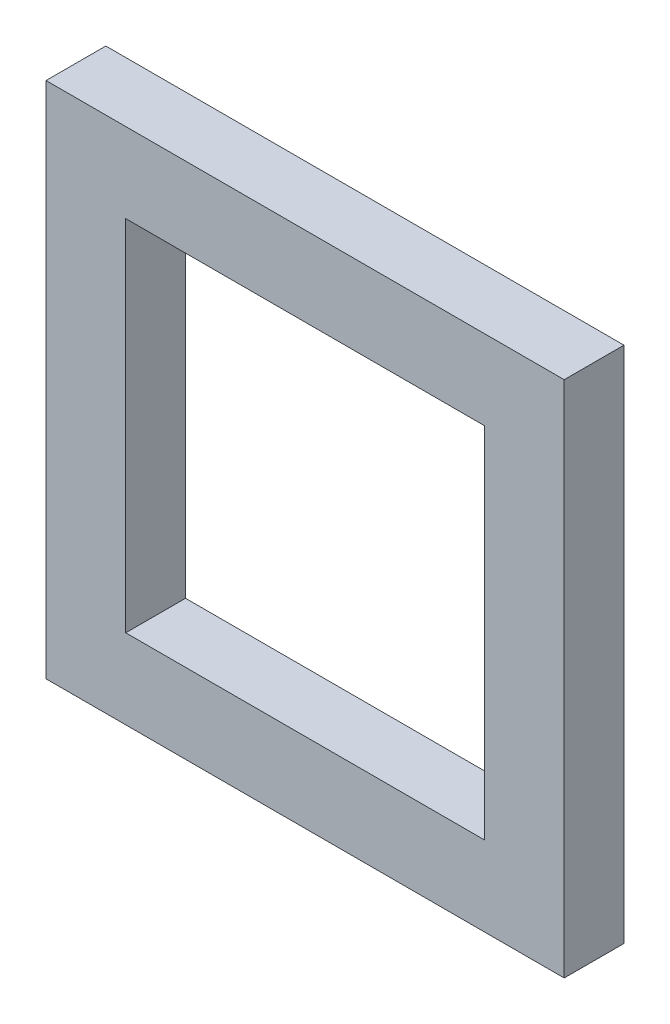
ISO-10303-21;
HEADER;
FILE_DESCRIPTION(('STEP AP214'),'2;1');
FILE_NAME('part.step','',(''),(''),'','','');
FILE_SCHEMA(('AUTOMOTIVE_DESIGN { 1 0 10303 214 1 1 1 1 }'));
ENDSEC;
DATA;
#1=APPLICATION_CONTEXT('core data for automotive mechanical design processes');
#2=APPLICATION_PROTOCOL_DEFINITION('international standard','automotive_design',2000,#1);
#3=PRODUCT_CONTEXT('',#1,'mechanical');
#4=PRODUCT('Part','Part','',(#3));
#5=PRODUCT_RELATED_PRODUCT_CATEGORY('part','',(#4));
#6=PRODUCT_DEFINITION_FORMATION('','',#4);
#7=PRODUCT_DEFINITION_CONTEXT('part definition',#1,'design');
#8=PRODUCT_DEFINITION('design','',#6,#7);
#9=PRODUCT_DEFINITION_SHAPE('','',#8);
#10=(LENGTH_UNIT() NAMED_UNIT(*) SI_UNIT(.MILLI.,.METRE.));
#11=(NAMED_UNIT(*) PLANE_ANGLE_UNIT() SI_UNIT($,.RADIAN.));
#12=(NAMED_UNIT(*) SI_UNIT($,.STERADIAN.) SOLID_ANGLE_UNIT());
#13=UNCERTAINTY_MEASURE_WITH_UNIT(LENGTH_MEASURE(1.E-05),#10,'distance_accuracy_value','');
#14=(GEOMETRIC_REPRESENTATION_CONTEXT(3) GLOBAL_UNCERTAINTY_ASSIGNED_CONTEXT((#13)) GLOBAL_UNIT_ASSIGNED_CONTEXT((#10,
#11,#12)) REPRESENTATION_CONTEXT('',''));
#15=CARTESIAN_POINT('',(0.,0.,0.));
#16=DIRECTION('',(0.,0.,1.));
#17=DIRECTION('',(1.,0.,0.));
#18=AXIS2_PLACEMENT_3D('',#15,#16,#17);
#19=CARTESIAN_POINT('',(0.,0.,1.5));
#20=DIRECTION('',(0.,0.,1.));
#21=DIRECTION('',(1.,0.,0.));
#22=AXIS2_PLACEMENT_3D('',#19,#20,#21);
#23=PLANE('',#22);
#24=DIRECTION('',(0.,-1.,0.));
#25=VECTOR('',#24,1.);
#26=CARTESIAN_POINT('',(-6.5,-6.5,1.5));
#27=LINE('',#26,#25);
#28=CARTESIAN_POINT('',(-6.5,6.5,1.5));
#29=VERTEX_POINT('',#28);
#30=CARTESIAN_POINT('',(-6.5,-6.5,1.5));
#31=VERTEX_POINT('',#30);
#32=EDGE_CURVE('E134',#29,#31,#27,.T.);
#33=ORIENTED_EDGE('',*,*,#32,.T.);
#34=DIRECTION('',(1.,0.,0.));
#35=VECTOR('',#34,1.);
#36=CARTESIAN_POINT('',(6.5,-6.5,1.5));
#37=LINE('',#36,#35);
#38=CARTESIAN_POINT('',(6.5,-6.5,1.5));
#39=VERTEX_POINT('',#38);
#40=EDGE_CURVE('E137',#31,#39,#37,.T.);
#41=ORIENTED_EDGE('',*,*,#40,.T.);
#42=DIRECTION('',(0.,1.,0.));
#43=VECTOR('',#42,1.);
#44=CARTESIAN_POINT('',(6.5,-6.5,1.5));
#45=LINE('',#44,#43);
#46=CARTESIAN_POINT('',(6.5,6.5,1.5));
#47=VERTEX_POINT('',#46);
#48=EDGE_CURVE('E140',#39,#47,#45,.T.);
#49=ORIENTED_EDGE('',*,*,#48,.T.);
#50=DIRECTION('',(-1.,0.,0.));
#51=VECTOR('',#50,1.);
#52=CARTESIAN_POINT('',(6.5,6.5,1.5));
#53=LINE('',#52,#51);
#54=EDGE_CURVE('E142',#47,#29,#53,.T.);
#55=ORIENTED_EDGE('',*,*,#54,.T.);
#56=EDGE_LOOP('',(#33,#41,#49,#55));
#57=FACE_BOUND('',#56,.T.);
#58=DIRECTION('',(1.,0.,0.));
#59=VECTOR('',#58,1.);
#60=CARTESIAN_POINT('',(4.5,-4.5,1.5));
#61=LINE('',#60,#59);
#62=CARTESIAN_POINT('',(-4.5,-4.5,1.5));
#63=VERTEX_POINT('',#62);
#64=CARTESIAN_POINT('',(4.5,-4.5,1.5));
#65=VERTEX_POINT('',#64);
#66=EDGE_CURVE('E106',#63,#65,#61,.T.);
#67=ORIENTED_EDGE('',*,*,#66,.F.);
#68=DIRECTION('',(0.,-1.,0.));
#69=VECTOR('',#68,1.);
#70=CARTESIAN_POINT('',(-4.5,-4.5,1.5));
#71=LINE('',#70,#69);
#72=CARTESIAN_POINT('',(-4.5,4.5,1.5));
#73=VERTEX_POINT('',#72);
#74=EDGE_CURVE('E98',#73,#63,#71,.T.);
#75=ORIENTED_EDGE('',*,*,#74,.F.);
#76=DIRECTION('',(-1.,0.,0.));
#77=VECTOR('',#76,1.);
#78=CARTESIAN_POINT('',(4.5,4.5,1.5));
#79=LINE('',#78,#77);
#80=CARTESIAN_POINT('',(4.5,4.5,1.5));
#81=VERTEX_POINT('',#80);
#82=EDGE_CURVE('E120',#81,#73,#79,.T.);
#83=ORIENTED_EDGE('',*,*,#82,.F.);
#84=DIRECTION('',(0.,1.,0.));
#85=VECTOR('',#84,1.);
#86=CARTESIAN_POINT('',(4.5,-4.5,1.5));
#87=LINE('',#86,#85);
#88=EDGE_CURVE('E118',#65,#81,#87,.T.);
#89=ORIENTED_EDGE('',*,*,#88,.F.);
#90=EDGE_LOOP('',(#67,#75,#83,#89));
#91=FACE_BOUND('',#90,.T.);
#92=ADVANCED_FACE('F33',(#57,#91),#23,.T.);
#93=CARTESIAN_POINT('',(0.,0.,0.));
#94=DIRECTION('',(0.,0.,1.));
#95=DIRECTION('',(1.,0.,0.));
#96=AXIS2_PLACEMENT_3D('',#93,#94,#95);
#97=PLANE('',#96);
#98=DIRECTION('',(0.,-1.,0.));
#99=VECTOR('',#98,1.);
#100=CARTESIAN_POINT('',(-6.5,-6.5,0.));
#101=LINE('',#100,#99);
#102=CARTESIAN_POINT('',(-6.5,6.5,0.));
#103=VERTEX_POINT('',#102);
#104=CARTESIAN_POINT('',(-6.5,-6.5,0.));
#105=VERTEX_POINT('',#104);
#106=EDGE_CURVE('E114',#103,#105,#101,.T.);
#107=ORIENTED_EDGE('',*,*,#106,.F.);
#108=DIRECTION('',(-1.,0.,0.));
#109=VECTOR('',#108,1.);
#110=CARTESIAN_POINT('',(6.5,6.5,0.));
#111=LINE('',#110,#109);
#112=CARTESIAN_POINT('',(6.5,6.5,0.));
#113=VERTEX_POINT('',#112);
#114=EDGE_CURVE('E138',#113,#103,#111,.T.);
#115=ORIENTED_EDGE('',*,*,#114,.F.);
#116=DIRECTION('',(0.,1.,0.));
#117=VECTOR('',#116,1.);
#118=CARTESIAN_POINT('',(6.5,-6.5,0.));
#119=LINE('',#118,#117);
#120=CARTESIAN_POINT('',(6.5,-6.5,0.));
#121=VERTEX_POINT('',#120);
#122=EDGE_CURVE('E149',#121,#113,#119,.T.);
#123=ORIENTED_EDGE('',*,*,#122,.F.);
#124=DIRECTION('',(1.,0.,0.));
#125=VECTOR('',#124,1.);
#126=CARTESIAN_POINT('',(6.5,-6.5,0.));
#127=LINE('',#126,#125);
#128=EDGE_CURVE('E147',#105,#121,#127,.T.);
#129=ORIENTED_EDGE('',*,*,#128,.F.);
#130=EDGE_LOOP('',(#107,#115,#123,#129));
#131=FACE_BOUND('',#130,.T.);
#132=DIRECTION('',(0.,-1.,0.));
#133=VECTOR('',#132,1.);
#134=CARTESIAN_POINT('',(-4.5,-4.5,0.));
#135=LINE('',#134,#133);
#136=CARTESIAN_POINT('',(-4.5,4.5,0.));
#137=VERTEX_POINT('',#136);
#138=CARTESIAN_POINT('',(-4.5,-4.5,0.));
#139=VERTEX_POINT('',#138);
#140=EDGE_CURVE('E56',#137,#139,#135,.T.);
#141=ORIENTED_EDGE('',*,*,#140,.T.);
#142=DIRECTION('',(1.,0.,0.));
#143=VECTOR('',#142,1.);
#144=CARTESIAN_POINT('',(4.5,-4.5,0.));
#145=LINE('',#144,#143);
#146=CARTESIAN_POINT('',(4.5,-4.5,0.));
#147=VERTEX_POINT('',#146);
#148=EDGE_CURVE('E113',#139,#147,#145,.T.);
#149=ORIENTED_EDGE('',*,*,#148,.T.);
#150=DIRECTION('',(0.,1.,0.));
#151=VECTOR('',#150,1.);
#152=CARTESIAN_POINT('',(4.5,-4.5,0.));
#153=LINE('',#152,#151);
#154=CARTESIAN_POINT('',(4.5,4.5,0.));
#155=VERTEX_POINT('',#154);
#156=EDGE_CURVE('E126',#147,#155,#153,.T.);
#157=ORIENTED_EDGE('',*,*,#156,.T.);
#158=DIRECTION('',(-1.,0.,0.));
#159=VECTOR('',#158,1.);
#160=CARTESIAN_POINT('',(4.5,4.5,0.));
#161=LINE('',#160,#159);
#162=EDGE_CURVE('E107',#155,#137,#161,.T.);
#163=ORIENTED_EDGE('',*,*,#162,.T.);
#164=EDGE_LOOP('',(#141,#149,#157,#163));
#165=FACE_BOUND('',#164,.T.);
#166=ADVANCED_FACE('F167',(#131,#165),#97,.F.);
#167=CARTESIAN_POINT('',(-6.5,-6.5,1.5));
#168=DIRECTION('',(1.,0.,0.));
#169=DIRECTION('',(0.,0.,-1.));
#170=AXIS2_PLACEMENT_3D('',#167,#168,#169);
#171=PLANE('',#170);
#172=ORIENTED_EDGE('',*,*,#106,.T.);
#173=DIRECTION('',(0.,0.,-1.));
#174=VECTOR('',#173,1.);
#175=CARTESIAN_POINT('',(-6.5,-6.5,1.5));
#176=LINE('',#175,#174);
#177=EDGE_CURVE('E11',#31,#105,#176,.T.);
#178=ORIENTED_EDGE('',*,*,#177,.F.);
#179=ORIENTED_EDGE('',*,*,#32,.F.);
#180=DIRECTION('',(0.,0.,-1.));
#181=VECTOR('',#180,1.);
#182=CARTESIAN_POINT('',(-6.5,6.5,1.5));
#183=LINE('',#182,#181);
#184=EDGE_CURVE('E144',#29,#103,#183,.T.);
#185=ORIENTED_EDGE('',*,*,#184,.T.);
#186=EDGE_LOOP('',(#172,#178,#179,#185));
#187=FACE_BOUND('',#186,.T.);
#188=ADVANCED_FACE('F35',(#187),#171,.F.);
#189=CARTESIAN_POINT('',(6.5,-6.5,1.5));
#190=DIRECTION('',(0.,1.,0.));
#191=DIRECTION('',(-1.,0.,0.));
#192=AXIS2_PLACEMENT_3D('',#189,#190,#191);
#193=PLANE('',#192);
#194=ORIENTED_EDGE('',*,*,#128,.T.);
#195=DIRECTION('',(0.,0.,-1.));
#196=VECTOR('',#195,1.);
#197=CARTESIAN_POINT('',(6.5,-6.5,1.5));
#198=LINE('',#197,#196);
#199=EDGE_CURVE('E41',#39,#121,#198,.T.);
#200=ORIENTED_EDGE('',*,*,#199,.F.);
#201=ORIENTED_EDGE('',*,*,#40,.F.);
#202=ORIENTED_EDGE('',*,*,#177,.T.);
#203=EDGE_LOOP('',(#194,#200,#201,#202));
#204=FACE_BOUND('',#203,.T.);
#205=ADVANCED_FACE('F177',(#204),#193,.F.);
#206=CARTESIAN_POINT('',(6.5,-6.5,1.5));
#207=DIRECTION('',(-1.,0.,0.));
#208=DIRECTION('',(0.,0.,1.));
#209=AXIS2_PLACEMENT_3D('',#206,#207,#208);
#210=PLANE('',#209);
#211=ORIENTED_EDGE('',*,*,#122,.T.);
#212=DIRECTION('',(0.,0.,-1.));
#213=VECTOR('',#212,1.);
#214=CARTESIAN_POINT('',(6.5,6.5,1.5));
#215=LINE('',#214,#213);
#216=EDGE_CURVE('E154',#47,#113,#215,.T.);
#217=ORIENTED_EDGE('',*,*,#216,.F.);
#218=ORIENTED_EDGE('',*,*,#48,.F.);
#219=ORIENTED_EDGE('',*,*,#199,.T.);
#220=EDGE_LOOP('',(#211,#217,#218,#219));
#221=FACE_BOUND('',#220,.T.);
#222=ADVANCED_FACE('F161',(#221),#210,.F.);
#223=CARTESIAN_POINT('',(6.5,6.5,1.5));
#224=DIRECTION('',(0.,-1.,0.));
#225=DIRECTION('',(0.,0.,-1.));
#226=AXIS2_PLACEMENT_3D('',#223,#224,#225);
#227=PLANE('',#226);
#228=ORIENTED_EDGE('',*,*,#114,.T.);
#229=ORIENTED_EDGE('',*,*,#184,.F.);
#230=ORIENTED_EDGE('',*,*,#54,.F.);
#231=ORIENTED_EDGE('',*,*,#216,.T.);
#232=EDGE_LOOP('',(#228,#229,#230,#231));
#233=FACE_BOUND('',#232,.T.);
#234=ADVANCED_FACE('F171',(#233),#227,.F.);
#235=CARTESIAN_POINT('',(-4.5,-4.5,1.5));
#236=DIRECTION('',(1.,0.,0.));
#237=DIRECTION('',(0.,0.,-1.));
#238=AXIS2_PLACEMENT_3D('',#235,#236,#237);
#239=PLANE('',#238);
#240=ORIENTED_EDGE('',*,*,#140,.F.);
#241=DIRECTION('',(0.,0.,-1.));
#242=VECTOR('',#241,1.);
#243=CARTESIAN_POINT('',(-4.5,4.5,1.5));
#244=LINE('',#243,#242);
#245=EDGE_CURVE('E102',#73,#137,#244,.T.);
#246=ORIENTED_EDGE('',*,*,#245,.F.);
#247=ORIENTED_EDGE('',*,*,#74,.T.);
#248=DIRECTION('',(0.,0.,-1.));
#249=VECTOR('',#248,1.);
#250=CARTESIAN_POINT('',(-4.5,-4.5,1.5));
#251=LINE('',#250,#249);
#252=EDGE_CURVE('E101',#63,#139,#251,.T.);
#253=ORIENTED_EDGE('',*,*,#252,.T.);
#254=EDGE_LOOP('',(#240,#246,#247,#253));
#255=FACE_BOUND('',#254,.T.);
#256=ADVANCED_FACE('F100',(#255),#239,.T.);
#257=CARTESIAN_POINT('',(4.5,-4.5,1.5));
#258=DIRECTION('',(0.,1.,0.));
#259=DIRECTION('',(-1.,0.,0.));
#260=AXIS2_PLACEMENT_3D('',#257,#258,#259);
#261=PLANE('',#260);
#262=ORIENTED_EDGE('',*,*,#148,.F.);
#263=ORIENTED_EDGE('',*,*,#252,.F.);
#264=ORIENTED_EDGE('',*,*,#66,.T.);
#265=DIRECTION('',(0.,0.,-1.));
#266=VECTOR('',#265,1.);
#267=CARTESIAN_POINT('',(4.5,-4.5,1.5));
#268=LINE('',#267,#266);
#269=EDGE_CURVE('E115',#65,#147,#268,.T.);
#270=ORIENTED_EDGE('',*,*,#269,.T.);
#271=EDGE_LOOP('',(#262,#263,#264,#270));
#272=FACE_BOUND('',#271,.T.);
#273=ADVANCED_FACE('F110',(#272),#261,.T.);
#274=CARTESIAN_POINT('',(4.5,-4.5,1.5));
#275=DIRECTION('',(-1.,0.,0.));
#276=DIRECTION('',(0.,0.,1.));
#277=AXIS2_PLACEMENT_3D('',#274,#275,#276);
#278=PLANE('',#277);
#279=ORIENTED_EDGE('',*,*,#156,.F.);
#280=ORIENTED_EDGE('',*,*,#269,.F.);
#281=ORIENTED_EDGE('',*,*,#88,.T.);
#282=DIRECTION('',(0.,0.,-1.));
#283=VECTOR('',#282,1.);
#284=CARTESIAN_POINT('',(4.5,4.5,1.5));
#285=LINE('',#284,#283);
#286=EDGE_CURVE('E48',#81,#155,#285,.T.);
#287=ORIENTED_EDGE('',*,*,#286,.T.);
#288=EDGE_LOOP('',(#279,#280,#281,#287));
#289=FACE_BOUND('',#288,.T.);
#290=ADVANCED_FACE('F200',(#289),#278,.T.);
#291=CARTESIAN_POINT('',(4.5,4.5,1.5));
#292=DIRECTION('',(0.,-1.,0.));
#293=DIRECTION('',(1.,0.,0.));
#294=AXIS2_PLACEMENT_3D('',#291,#292,#293);
#295=PLANE('',#294);
#296=ORIENTED_EDGE('',*,*,#162,.F.);
#297=ORIENTED_EDGE('',*,*,#286,.F.);
#298=ORIENTED_EDGE('',*,*,#82,.T.);
#299=ORIENTED_EDGE('',*,*,#245,.T.);
#300=EDGE_LOOP('',(#296,#297,#298,#299));
#301=FACE_BOUND('',#300,.T.);
#302=ADVANCED_FACE('F204',(#301),#295,.T.);
#303=CLOSED_SHELL('',(#92,#166,#188,#205,#222,#234,#256,#273,#290,#302));
#304=MANIFOLD_SOLID_BREP('B2',#303);
#305=ADVANCED_BREP_SHAPE_REPRESENTATION('',(#18,#304),#14);
#306=SHAPE_DEFINITION_REPRESENTATION(#9,#305);
ENDSEC;
END-ISO-10303-21;
